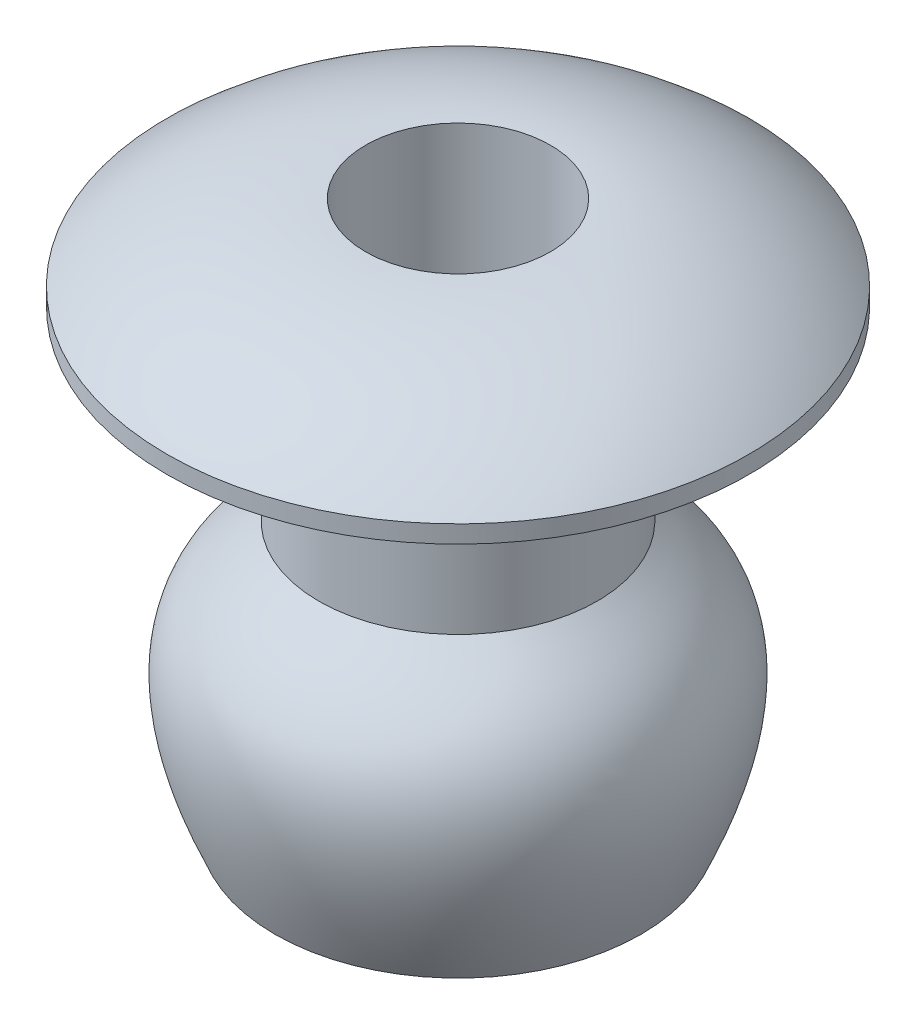
ISO-10303-21;
HEADER;
FILE_DESCRIPTION(('STEP AP214'),'2;1');
FILE_NAME('part.step','',(''),(''),'','','');
FILE_SCHEMA(('AUTOMOTIVE_DESIGN { 1 0 10303 214 1 1 1 1 }'));
ENDSEC;
DATA;
#1=APPLICATION_CONTEXT('core data for automotive mechanical design processes');
#2=APPLICATION_PROTOCOL_DEFINITION('international standard','automotive_design',2000,#1);
#3=PRODUCT_CONTEXT('',#1,'mechanical');
#4=PRODUCT('Part','Part','',(#3));
#5=PRODUCT_RELATED_PRODUCT_CATEGORY('part','',(#4));
#6=PRODUCT_DEFINITION_FORMATION('','',#4);
#7=PRODUCT_DEFINITION_CONTEXT('part definition',#1,'design');
#8=PRODUCT_DEFINITION('design','',#6,#7);
#9=PRODUCT_DEFINITION_SHAPE('','',#8);
#10=(LENGTH_UNIT() NAMED_UNIT(*) SI_UNIT(.MILLI.,.METRE.));
#11=(NAMED_UNIT(*) PLANE_ANGLE_UNIT() SI_UNIT($,.RADIAN.));
#12=(NAMED_UNIT(*) SI_UNIT($,.STERADIAN.) SOLID_ANGLE_UNIT());
#13=UNCERTAINTY_MEASURE_WITH_UNIT(LENGTH_MEASURE(1.E-05),#10,'distance_accuracy_value','');
#14=(GEOMETRIC_REPRESENTATION_CONTEXT(3) GLOBAL_UNCERTAINTY_ASSIGNED_CONTEXT((#13)) GLOBAL_UNIT_ASSIGNED_CONTEXT((#10,
#11,#12)) REPRESENTATION_CONTEXT('',''));
#15=CARTESIAN_POINT('',(0.,0.,0.));
#16=DIRECTION('',(0.,0.,1.));
#17=DIRECTION('',(1.,0.,0.));
#18=AXIS2_PLACEMENT_3D('',#15,#16,#17);
#19=CARTESIAN_POINT('',(-1.94289029309402E-13,0.,2.38125000000022));
#20=DIRECTION('',(0.,-1.,0.));
#21=DIRECTION('',(0.,0.,-1.));
#22=AXIS2_PLACEMENT_3D('',#19,#20,#21);
#23=PLANE('',#22);
#24=CARTESIAN_POINT('',(0.,0.,0.));
#25=DIRECTION('',(0.,1.,0.));
#26=DIRECTION('',(0.,0.,1.));
#27=AXIS2_PLACEMENT_3D('',#24,#25,#26);
#28=CIRCLE('',#27,2.38125);
#29=CARTESIAN_POINT('',(0.,0.,2.38125));
#30=VERTEX_POINT('',#29);
#31=EDGE_CURVE('E12',#30,#30,#28,.T.);
#32=ORIENTED_EDGE('',*,*,#31,.T.);
#33=EDGE_LOOP('',(#32));
#34=FACE_BOUND('',#33,.T.);
#35=CARTESIAN_POINT('',(0.,0.,0.));
#36=DIRECTION('',(0.,1.,0.));
#37=DIRECTION('',(0.,0.,1.));
#38=AXIS2_PLACEMENT_3D('',#35,#36,#37);
#39=CIRCLE('',#38,4.9784);
#40=CARTESIAN_POINT('',(0.,0.,4.97840000000001));
#41=VERTEX_POINT('',#40);
#42=EDGE_CURVE('E75',#41,#41,#39,.T.);
#43=ORIENTED_EDGE('',*,*,#42,.F.);
#44=EDGE_LOOP('',(#43));
#45=FACE_BOUND('',#44,.T.);
#46=ADVANCED_FACE('F38',(#34,#45),#23,.T.);
#47=CARTESIAN_POINT('',(0.,0.,0.));
#48=DIRECTION('',(0.,1.,0.));
#49=DIRECTION('',(0.,0.,1.));
#50=AXIS2_PLACEMENT_3D('',#47,#48,#49);
#51=CYLINDRICAL_SURFACE('',#50,2.38125);
#52=CARTESIAN_POINT('',(1.38777878078145E-13,-3.17499999999998,2.4980018054066E-13));
#53=DIRECTION('',(0.,1.,0.));
#54=DIRECTION('',(0.,0.,1.));
#55=AXIS2_PLACEMENT_3D('',#52,#53,#54);
#56=CIRCLE('',#55,2.38125);
#57=CARTESIAN_POINT('',(1.39570993651361E-13,-3.17499999999998,2.38125000000025));
#58=VERTEX_POINT('',#57);
#59=EDGE_CURVE('E44',#58,#58,#56,.T.);
#60=ORIENTED_EDGE('',*,*,#59,.T.);
#61=EDGE_LOOP('',(#60));
#62=FACE_BOUND('',#61,.T.);
#63=ORIENTED_EDGE('',*,*,#31,.F.);
#64=EDGE_LOOP('',(#63));
#65=FACE_BOUND('',#64,.T.);
#66=ADVANCED_FACE('F110',(#62,#65),#51,.T.);
#67=CARTESIAN_POINT('',(0.,-3.17499999999998,2.38125));
#68=CARTESIAN_POINT('',(0.,-3.98776935881401,3.28520911612407));
#69=CARTESIAN_POINT('',(0.,-4.69339441010083,4.48157213229439));
#70=CARTESIAN_POINT('',(-1.94289029309402E-13,-7.73499999999999,3.13125000000025));
#71=B_SPLINE_CURVE_WITH_KNOTS('',3,(#67,#68,#69,#70),.UNSPECIFIED.,.F.,.F.,(4,4),(0.,
0.915818094817049),.UNSPECIFIED.);
#72=CARTESIAN_POINT('',(0.,0.,0.));
#73=DIRECTION('',(0.,1.,0.));
#74=AXIS1_PLACEMENT('',#72,#73);
#75=SURFACE_OF_REVOLUTION('',#71,#74);
#76=CARTESIAN_POINT('',(0.,-7.73499999999999,1.11022302462516E-13));
#77=DIRECTION('',(0.,1.,0.));
#78=DIRECTION('',(0.,0.,1.));
#79=AXIS2_PLACEMENT_3D('',#76,#77,#78);
#80=CIRCLE('',#79,3.13125);
#81=CARTESIAN_POINT('',(0.,-7.73499999999999,3.13125000000011));
#82=VERTEX_POINT('',#81);
#83=EDGE_CURVE('E48',#82,#82,#80,.T.);
#84=ORIENTED_EDGE('',*,*,#83,.T.);
#85=EDGE_LOOP('',(#84));
#86=FACE_BOUND('',#85,.T.);
#87=ORIENTED_EDGE('',*,*,#59,.F.);
#88=EDGE_LOOP('',(#87));
#89=FACE_BOUND('',#88,.T.);
#90=ADVANCED_FACE('F107',(#86,#89),#75,.F.);
#91=CARTESIAN_POINT('',(-2.22044604925031E-13,-7.73499999999999,2.40976314974481));
#92=DIRECTION('',(0.,-1.,0.));
#93=DIRECTION('',(0.,0.,-1.));
#94=AXIS2_PLACEMENT_3D('',#91,#92,#93);
#95=PLANE('',#94);
#96=CARTESIAN_POINT('',(0.,-7.73499999999999,1.11022302462516E-13));
#97=DIRECTION('',(0.,1.,0.));
#98=DIRECTION('',(0.,0.,1.));
#99=AXIS2_PLACEMENT_3D('',#96,#97,#98);
#100=CIRCLE('',#99,2.40976314974505);
#101=CARTESIAN_POINT('',(0.,-7.73499999999999,2.40976314974516));
#102=VERTEX_POINT('',#101);
#103=EDGE_CURVE('E52',#102,#102,#100,.T.);
#104=ORIENTED_EDGE('',*,*,#103,.T.);
#105=EDGE_LOOP('',(#104));
#106=FACE_BOUND('',#105,.T.);
#107=ORIENTED_EDGE('',*,*,#83,.F.);
#108=EDGE_LOOP('',(#107));
#109=FACE_BOUND('',#108,.T.);
#110=ADVANCED_FACE('F103',(#106,#109),#95,.T.);
#111=CARTESIAN_POINT('',(0.,-7.635,1.11022302462516E-13));
#112=DIRECTION('',(0.,1.,0.));
#113=DIRECTION('',(0.,0.,1.));
#114=AXIS2_PLACEMENT_3D('',#111,#112,#113);
#115=TOROIDAL_SURFACE('',#114,2.40976314974505,0.0999999999999997);
#116=CARTESIAN_POINT('',(0.,-7.59442386043158,1.11022302462516E-13));
#117=DIRECTION('',(0.,1.,0.));
#118=DIRECTION('',(0.,0.,1.));
#119=AXIS2_PLACEMENT_3D('',#116,#117,#118);
#120=CIRCLE('',#119,2.31836524551456);
#121=CARTESIAN_POINT('',(0.,-7.59442386043158,2.31836524551467));
#122=VERTEX_POINT('',#121);
#123=EDGE_CURVE('E57',#122,#122,#120,.T.);
#124=ORIENTED_EDGE('',*,*,#123,.T.);
#125=EDGE_LOOP('',(#124));
#126=FACE_BOUND('',#125,.T.);
#127=ORIENTED_EDGE('',*,*,#103,.F.);
#128=EDGE_LOOP('',(#127));
#129=FACE_BOUND('',#128,.T.);
#130=ADVANCED_FACE('F99',(#126,#129),#115,.T.);
#131=CARTESIAN_POINT('',(0.,-7.59442386043158,1.11022302462516E-13));
#132=DIRECTION('',(0.,1.,0.));
#133=DIRECTION('',(0.,0.,1.));
#134=AXIS2_PLACEMENT_3D('',#131,#132,#133);
#135=CONICAL_SURFACE('',#134,2.31836524551456,0.4178117326811);
#136=CARTESIAN_POINT('',(0.,-7.4103908834528,1.11022302462516E-13));
#137=DIRECTION('',(0.,1.,0.));
#138=DIRECTION('',(0.,0.,1.));
#139=AXIS2_PLACEMENT_3D('',#136,#137,#138);
#140=CIRCLE('',#139,2.40006676615608);
#141=CARTESIAN_POINT('',(0.,-7.4103908834528,2.40006676615619));
#142=VERTEX_POINT('',#141);
#143=EDGE_CURVE('E60',#142,#142,#140,.T.);
#144=ORIENTED_EDGE('',*,*,#143,.T.);
#145=EDGE_LOOP('',(#144));
#146=FACE_BOUND('',#145,.T.);
#147=ORIENTED_EDGE('',*,*,#123,.F.);
#148=EDGE_LOOP('',(#147));
#149=FACE_BOUND('',#148,.T.);
#150=ADVANCED_FACE('F94',(#146,#149),#135,.F.);
#151=CARTESIAN_POINT('',(1.38777878078145E-13,-7.4103908834528,2.40006676615612));
#152=CARTESIAN_POINT('',(0.,-7.2450247404357,2.47348113769374));
#153=CARTESIAN_POINT('',(0.,-6.89314166060556,2.61867148236306));
#154=CARTESIAN_POINT('',(0.,-6.31290956550862,2.81545966396846));
#155=CARTESIAN_POINT('',(0.,-5.71767703447174,2.94225318186392));
#156=CARTESIAN_POINT('',(0.,-5.22105529600575,2.94337461023003));
#157=CARTESIAN_POINT('',(1.11022302462516E-13,-4.77496810667827,2.8341125174467));
#158=CARTESIAN_POINT('',(0.,-4.44963879532662,2.60243875600707));
#159=CARTESIAN_POINT('',(-2.77555756156289E-13,-4.08677788772913,2.21236579539105));
#160=CARTESIAN_POINT('',(0.,-3.8743536413893,1.9625454121508));
#161=CARTESIAN_POINT('',(-2.22044604925031E-13,-3.76989501848884,1.84636691279594));
#162=B_SPLINE_CURVE_WITH_KNOTS('',3,(#151,#152,#153,#154,#155,#156,#157,#158,#159,#160,#161),
.UNSPECIFIED.,.F.,.F.,(4,1,1,1,1,1,1,1,4),(0.,0.0572386309260656,0.114477261852131,
0.228954523704262,0.343431785556394,0.457909047408525,0.686863571112787,0.801340832964918,
0.915818094817049),.UNSPECIFIED.);
#163=CARTESIAN_POINT('',(0.,0.,0.));
#164=DIRECTION('',(0.,1.,0.));
#165=AXIS1_PLACEMENT('',#163,#164);
#166=SURFACE_OF_REVOLUTION('',#162,#165);
#167=CARTESIAN_POINT('',(1.11022302462516E-13,-3.76989501848884,2.4980018054066E-13));
#168=DIRECTION('',(0.,1.,0.));
#169=DIRECTION('',(0.,0.,1.));
#170=AXIS2_PLACEMENT_3D('',#167,#168,#169);
#171=CIRCLE('',#170,1.84636691279577);
#172=CARTESIAN_POINT('',(1.11637266180063E-13,-3.76989501848885,1.84636691279602));
#173=VERTEX_POINT('',#172);
#174=EDGE_CURVE('E63',#173,#173,#171,.T.);
#175=ORIENTED_EDGE('',*,*,#174,.T.);
#176=EDGE_LOOP('',(#175));
#177=FACE_BOUND('',#176,.T.);
#178=ORIENTED_EDGE('',*,*,#143,.F.);
#179=EDGE_LOOP('',(#178));
#180=FACE_BOUND('',#179,.T.);
#181=ADVANCED_FACE('F89',(#177,#180),#166,.F.);
#182=CARTESIAN_POINT('',(1.11022302462516E-13,-3.76989501848884,2.4980018054066E-13));
#183=DIRECTION('',(0.,-1.,0.));
#184=DIRECTION('',(0.,0.,-1.));
#185=AXIS2_PLACEMENT_3D('',#182,#183,#184);
#186=CONICAL_SURFACE('',#185,1.84636691279577,0.838466623454227);
#187=CARTESIAN_POINT('',(1.11022302462516E-13,-3.53152261936124,2.4980018054066E-13));
#188=DIRECTION('',(0.,1.,0.));
#189=DIRECTION('',(0.,0.,1.));
#190=AXIS2_PLACEMENT_3D('',#187,#188,#189);
#191=CIRCLE('',#190,1.58125);
#192=CARTESIAN_POINT('',(1.11548964509822E-13,-3.53152261936124,1.58125000000025));
#193=VERTEX_POINT('',#192);
#194=EDGE_CURVE('E66',#193,#193,#191,.T.);
#195=ORIENTED_EDGE('',*,*,#194,.T.);
#196=EDGE_LOOP('',(#195));
#197=FACE_BOUND('',#196,.T.);
#198=ORIENTED_EDGE('',*,*,#174,.F.);
#199=EDGE_LOOP('',(#198));
#200=FACE_BOUND('',#199,.T.);
#201=ADVANCED_FACE('F93',(#197,#200),#186,.F.);
#202=CARTESIAN_POINT('',(0.,0.,0.));
#203=DIRECTION('',(0.,1.,0.));
#204=DIRECTION('',(0.,0.,1.));
#205=AXIS2_PLACEMENT_3D('',#202,#203,#204);
#206=CYLINDRICAL_SURFACE('',#205,1.58125);
#207=CARTESIAN_POINT('',(1.11022302462516E-13,1.6002,2.4980018054066E-13));
#208=DIRECTION('',(0.,1.,0.));
#209=DIRECTION('',(0.,0.,1.));
#210=AXIS2_PLACEMENT_3D('',#207,#208,#209);
#211=CIRCLE('',#210,1.58125);
#212=CARTESIAN_POINT('',(1.11548964509822E-13,1.6002,1.58125000000025));
#213=VERTEX_POINT('',#212);
#214=EDGE_CURVE('E69',#213,#213,#211,.T.);
#215=ORIENTED_EDGE('',*,*,#214,.T.);
#216=EDGE_LOOP('',(#215));
#217=FACE_BOUND('',#216,.T.);
#218=ORIENTED_EDGE('',*,*,#194,.F.);
#219=EDGE_LOOP('',(#218));
#220=FACE_BOUND('',#219,.T.);
#221=ADVANCED_FACE('F131',(#217,#220),#206,.F.);
#222=CARTESIAN_POINT('',(1.11022302462516E-13,-3.48792035167667,2.4980018054066E-13));
#223=DIRECTION('',(0.,1.,0.));
#224=DIRECTION('',(0.,0.,1.));
#225=AXIS2_PLACEMENT_3D('',#222,#223,#224);
#226=DEGENERATE_TOROIDAL_SURFACE('',#225,1.58125,5.08812035167666,.T.);
#227=CARTESIAN_POINT('',(0.,0.299999999999967,0.));
#228=DIRECTION('',(0.,1.,0.));
#229=DIRECTION('',(0.,0.,1.));
#230=AXIS2_PLACEMENT_3D('',#227,#228,#229);
#231=CIRCLE('',#230,4.9784);
#232=CARTESIAN_POINT('',(0.,0.299999999999965,4.97839999999998));
#233=VERTEX_POINT('',#232);
#234=EDGE_CURVE('E72',#233,#233,#231,.T.);
#235=ORIENTED_EDGE('',*,*,#234,.T.);
#236=EDGE_LOOP('',(#235));
#237=FACE_BOUND('',#236,.T.);
#238=ORIENTED_EDGE('',*,*,#214,.F.);
#239=EDGE_LOOP('',(#238));
#240=FACE_BOUND('',#239,.T.);
#241=ADVANCED_FACE('F125',(#237,#240),#226,.T.);
#242=CARTESIAN_POINT('',(0.,0.,0.));
#243=DIRECTION('',(0.,1.,0.));
#244=DIRECTION('',(0.,0.,1.));
#245=AXIS2_PLACEMENT_3D('',#242,#243,#244);
#246=CYLINDRICAL_SURFACE('',#245,4.9784);
#247=ORIENTED_EDGE('',*,*,#42,.T.);
#248=EDGE_LOOP('',(#247));
#249=FACE_BOUND('',#248,.T.);
#250=ORIENTED_EDGE('',*,*,#234,.F.);
#251=EDGE_LOOP('',(#250));
#252=FACE_BOUND('',#251,.T.);
#253=ADVANCED_FACE('F122',(#249,#252),#246,.T.);
#254=CLOSED_SHELL('',(#46,#66,#90,#110,#130,#150,#181,#201,#221,#241,#253));
#255=MANIFOLD_SOLID_BREP('B2',#254);
#256=ADVANCED_BREP_SHAPE_REPRESENTATION('',(#18,#255),#14);
#257=SHAPE_DEFINITION_REPRESENTATION(#9,#256);
ENDSEC;
END-ISO-10303-21;
